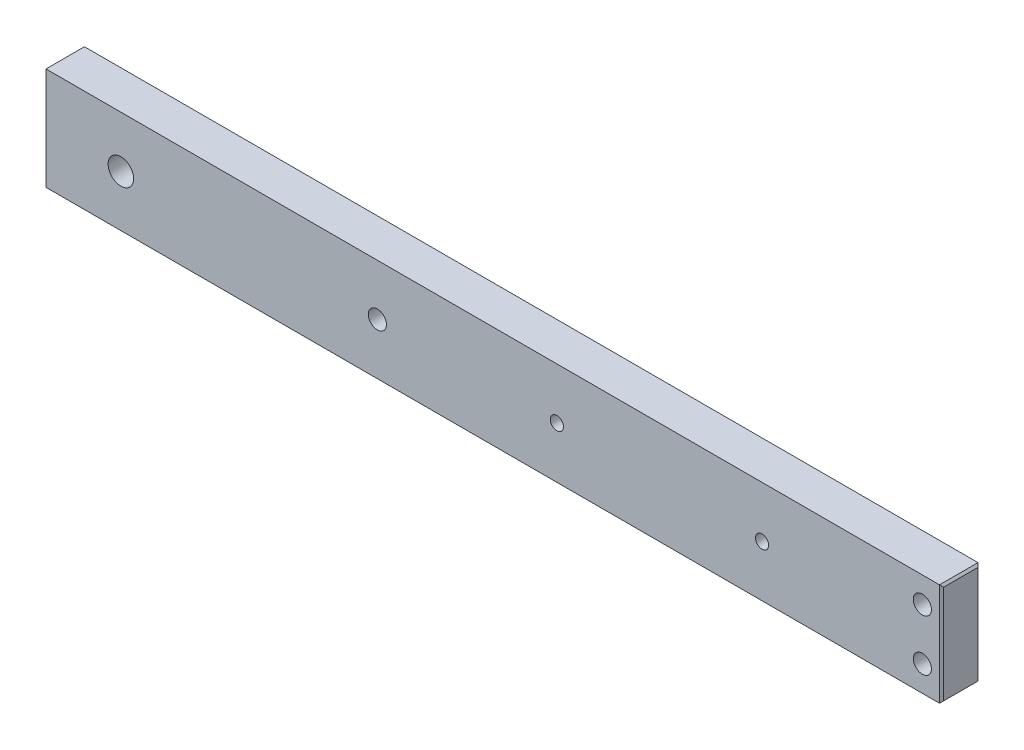
ISO-10303-21;
HEADER;
FILE_DESCRIPTION(('STEP AP214'),'2;1');
FILE_NAME('part.step','',(''),(''),'','','');
FILE_SCHEMA(('AUTOMOTIVE_DESIGN { 1 0 10303 214 1 1 1 1 }'));
ENDSEC;
DATA;
#1=APPLICATION_CONTEXT('core data for automotive mechanical design processes');
#2=APPLICATION_PROTOCOL_DEFINITION('international standard','automotive_design',2000,#1);
#3=PRODUCT_CONTEXT('',#1,'mechanical');
#4=PRODUCT('Part','Part','',(#3));
#5=PRODUCT_RELATED_PRODUCT_CATEGORY('part','',(#4));
#6=PRODUCT_DEFINITION_FORMATION('','',#4);
#7=PRODUCT_DEFINITION_CONTEXT('part definition',#1,'design');
#8=PRODUCT_DEFINITION('design','',#6,#7);
#9=PRODUCT_DEFINITION_SHAPE('','',#8);
#10=(LENGTH_UNIT() NAMED_UNIT(*) SI_UNIT(.MILLI.,.METRE.));
#11=(NAMED_UNIT(*) PLANE_ANGLE_UNIT() SI_UNIT($,.RADIAN.));
#12=(NAMED_UNIT(*) SI_UNIT($,.STERADIAN.) SOLID_ANGLE_UNIT());
#13=UNCERTAINTY_MEASURE_WITH_UNIT(LENGTH_MEASURE(1.E-05),#10,'distance_accuracy_value','');
#14=(GEOMETRIC_REPRESENTATION_CONTEXT(3) GLOBAL_UNCERTAINTY_ASSIGNED_CONTEXT((#13)) GLOBAL_UNIT_ASSIGNED_CONTEXT((#10,
#11,#12)) REPRESENTATION_CONTEXT('',''));
#15=CARTESIAN_POINT('',(0.,0.,0.));
#16=DIRECTION('',(0.,0.,1.));
#17=DIRECTION('',(1.,0.,0.));
#18=AXIS2_PLACEMENT_3D('',#15,#16,#17);
#19=CARTESIAN_POINT('',(0.,0.,9.525));
#20=DIRECTION('',(-1.,0.,0.));
#21=DIRECTION('',(0.,0.,1.));
#22=AXIS2_PLACEMENT_3D('',#19,#20,#21);
#23=PLANE('',#22);
#24=DIRECTION('',(0.,-1.,0.));
#25=VECTOR('',#24,1.);
#26=CARTESIAN_POINT('',(0.,0.,9.01699999999999));
#27=LINE('',#26,#25);
#28=CARTESIAN_POINT('',(0.,24.892,9.01699999999999));
#29=VERTEX_POINT('',#28);
#30=CARTESIAN_POINT('',(0.,0.508000000000008,9.01699999999999));
#31=VERTEX_POINT('',#30);
#32=EDGE_CURVE('E123',#29,#31,#27,.T.);
#33=ORIENTED_EDGE('',*,*,#32,.T.);
#34=DIRECTION('',(0.,0.,-1.));
#35=VECTOR('',#34,1.);
#36=CARTESIAN_POINT('',(0.,0.508000000000008,9.525));
#37=LINE('',#36,#35);
#38=CARTESIAN_POINT('',(0.,0.508000000000008,0.508000000000008));
#39=VERTEX_POINT('',#38);
#40=EDGE_CURVE('E105',#31,#39,#37,.T.);
#41=ORIENTED_EDGE('',*,*,#40,.T.);
#42=DIRECTION('',(0.,1.,0.));
#43=VECTOR('',#42,1.);
#44=CARTESIAN_POINT('',(0.,0.,0.508000000000008));
#45=LINE('',#44,#43);
#46=CARTESIAN_POINT('',(0.,24.892,0.508000000000008));
#47=VERTEX_POINT('',#46);
#48=EDGE_CURVE('E113',#39,#47,#45,.T.);
#49=ORIENTED_EDGE('',*,*,#48,.T.);
#50=DIRECTION('',(0.,0.,1.));
#51=VECTOR('',#50,1.);
#52=CARTESIAN_POINT('',(0.,24.892,9.525));
#53=LINE('',#52,#51);
#54=EDGE_CURVE('E119',#47,#29,#53,.T.);
#55=ORIENTED_EDGE('',*,*,#54,.T.);
#56=EDGE_LOOP('',(#33,#41,#49,#55));
#57=FACE_BOUND('',#56,.T.);
#58=ADVANCED_FACE('F35',(#57),#23,.F.);
#59=CARTESIAN_POINT('',(0.,25.4,9.525));
#60=DIRECTION('',(0.,-1.,0.));
#61=DIRECTION('',(1.,0.,0.));
#62=AXIS2_PLACEMENT_3D('',#59,#60,#61);
#63=PLANE('',#62);
#64=DIRECTION('',(-1.,0.,0.));
#65=VECTOR('',#64,1.);
#66=CARTESIAN_POINT('',(0.,25.4,9.525));
#67=LINE('',#66,#65);
#68=CARTESIAN_POINT('',(-0.508000000000036,25.4,9.525));
#69=VERTEX_POINT('',#68);
#70=CARTESIAN_POINT('',(-221.742,25.4,9.525));
#71=VERTEX_POINT('',#70);
#72=EDGE_CURVE('E182',#69,#71,#67,.T.);
#73=ORIENTED_EDGE('',*,*,#72,.F.);
#74=DIRECTION('',(0.,0.,-1.));
#75=VECTOR('',#74,1.);
#76=CARTESIAN_POINT('',(-0.508000000000036,25.4,9.525));
#77=LINE('',#76,#75);
#78=CARTESIAN_POINT('',(-0.508000000000036,25.4,0.));
#79=VERTEX_POINT('',#78);
#80=EDGE_CURVE('E139',#69,#79,#77,.T.);
#81=ORIENTED_EDGE('',*,*,#80,.T.);
#82=DIRECTION('',(-1.,0.,0.));
#83=VECTOR('',#82,1.);
#84=CARTESIAN_POINT('',(0.,25.4,0.));
#85=LINE('',#84,#83);
#86=CARTESIAN_POINT('',(-221.742,25.4,0.));
#87=VERTEX_POINT('',#86);
#88=EDGE_CURVE('E183',#79,#87,#85,.T.);
#89=ORIENTED_EDGE('',*,*,#88,.T.);
#90=DIRECTION('',(0.,0.,1.));
#91=VECTOR('',#90,1.);
#92=CARTESIAN_POINT('',(-221.742,25.4,9.525));
#93=LINE('',#92,#91);
#94=EDGE_CURVE('E136',#87,#71,#93,.T.);
#95=ORIENTED_EDGE('',*,*,#94,.T.);
#96=EDGE_LOOP('',(#73,#81,#89,#95));
#97=FACE_BOUND('',#96,.T.);
#98=ADVANCED_FACE('F263',(#97),#63,.F.);
#99=CARTESIAN_POINT('',(-222.25,0.,9.525));
#100=DIRECTION('',(1.,0.,0.));
#101=DIRECTION('',(0.,0.,-1.));
#102=AXIS2_PLACEMENT_3D('',#99,#100,#101);
#103=PLANE('',#102);
#104=DIRECTION('',(0.,1.,0.));
#105=VECTOR('',#104,1.);
#106=CARTESIAN_POINT('',(-222.25,25.4,9.01699999999999));
#107=LINE('',#106,#105);
#108=CARTESIAN_POINT('',(-222.25,0.507999999999981,9.01699999999999));
#109=VERTEX_POINT('',#108);
#110=CARTESIAN_POINT('',(-222.25,24.892,9.01699999999999));
#111=VERTEX_POINT('',#110);
#112=EDGE_CURVE('E44',#109,#111,#107,.T.);
#113=ORIENTED_EDGE('',*,*,#112,.T.);
#114=DIRECTION('',(0.,0.,-1.));
#115=VECTOR('',#114,1.);
#116=CARTESIAN_POINT('',(-222.25,24.892,9.525));
#117=LINE('',#116,#115);
#118=CARTESIAN_POINT('',(-222.25,24.892,0.508000000000008));
#119=VERTEX_POINT('',#118);
#120=EDGE_CURVE('E11',#111,#119,#117,.T.);
#121=ORIENTED_EDGE('',*,*,#120,.T.);
#122=DIRECTION('',(0.,-1.,0.));
#123=VECTOR('',#122,1.);
#124=CARTESIAN_POINT('',(-222.25,0.,0.508000000000008));
#125=LINE('',#124,#123);
#126=CARTESIAN_POINT('',(-222.25,0.507999999999981,0.508000000000008));
#127=VERTEX_POINT('',#126);
#128=EDGE_CURVE('E145',#119,#127,#125,.T.);
#129=ORIENTED_EDGE('',*,*,#128,.T.);
#130=DIRECTION('',(0.,0.,1.));
#131=VECTOR('',#130,1.);
#132=CARTESIAN_POINT('',(-222.25,0.507999999999981,9.525));
#133=LINE('',#132,#131);
#134=EDGE_CURVE('E55',#127,#109,#133,.T.);
#135=ORIENTED_EDGE('',*,*,#134,.T.);
#136=EDGE_LOOP('',(#113,#121,#129,#135));
#137=FACE_BOUND('',#136,.T.);
#138=ADVANCED_FACE('F268',(#137),#103,.F.);
#139=CARTESIAN_POINT('',(0.,0.,9.525));
#140=DIRECTION('',(0.,1.,0.));
#141=DIRECTION('',(-1.,0.,0.));
#142=AXIS2_PLACEMENT_3D('',#139,#140,#141);
#143=PLANE('',#142);
#144=DIRECTION('',(1.,0.,0.));
#145=VECTOR('',#144,1.);
#146=CARTESIAN_POINT('',(0.,0.,0.));
#147=LINE('',#146,#145);
#148=CARTESIAN_POINT('',(-221.742,0.,0.));
#149=VERTEX_POINT('',#148);
#150=CARTESIAN_POINT('',(-0.508000000000036,0.,0.));
#151=VERTEX_POINT('',#150);
#152=EDGE_CURVE('E176',#149,#151,#147,.T.);
#153=ORIENTED_EDGE('',*,*,#152,.T.);
#154=DIRECTION('',(0.,0.,1.));
#155=VECTOR('',#154,1.);
#156=CARTESIAN_POINT('',(-0.508000000000036,0.,9.525));
#157=LINE('',#156,#155);
#158=CARTESIAN_POINT('',(-0.508000000000036,0.,9.525));
#159=VERTEX_POINT('',#158);
#160=EDGE_CURVE('E107',#151,#159,#157,.T.);
#161=ORIENTED_EDGE('',*,*,#160,.T.);
#162=DIRECTION('',(1.,0.,0.));
#163=VECTOR('',#162,1.);
#164=CARTESIAN_POINT('',(0.,0.,9.525));
#165=LINE('',#164,#163);
#166=CARTESIAN_POINT('',(-221.742,0.,9.525));
#167=VERTEX_POINT('',#166);
#168=EDGE_CURVE('E120',#167,#159,#165,.T.);
#169=ORIENTED_EDGE('',*,*,#168,.F.);
#170=DIRECTION('',(0.,0.,-1.));
#171=VECTOR('',#170,1.);
#172=CARTESIAN_POINT('',(-221.742,0.,9.525));
#173=LINE('',#172,#171);
#174=EDGE_CURVE('E125',#167,#149,#173,.T.);
#175=ORIENTED_EDGE('',*,*,#174,.T.);
#176=EDGE_LOOP('',(#153,#161,#169,#175));
#177=FACE_BOUND('',#176,.T.);
#178=ADVANCED_FACE('F175',(#177),#143,.F.);
#179=CARTESIAN_POINT('',(0.,0.,9.525));
#180=DIRECTION('',(0.,0.,1.));
#181=DIRECTION('',(1.,0.,0.));
#182=AXIS2_PLACEMENT_3D('',#179,#180,#181);
#183=PLANE('',#182);
#184=CARTESIAN_POINT('',(-95.2500000000001,12.7,9.525));
#185=DIRECTION('',(0.,0.,-1.));
#186=DIRECTION('',(-1.,0.,0.));
#187=AXIS2_PLACEMENT_3D('',#184,#185,#186);
#188=CIRCLE('',#187,1.63194999999999);
#189=CARTESIAN_POINT('',(-96.88195,12.7,9.525));
#190=VERTEX_POINT('',#189);
#191=EDGE_CURVE('E228',#190,#190,#188,.T.);
#192=ORIENTED_EDGE('',*,*,#191,.T.);
#193=EDGE_LOOP('',(#192));
#194=FACE_BOUND('',#193,.T.);
#195=CARTESIAN_POINT('',(-44.4500000000001,12.7,9.525));
#196=DIRECTION('',(0.,0.,-1.));
#197=DIRECTION('',(-1.,0.,0.));
#198=AXIS2_PLACEMENT_3D('',#195,#196,#197);
#199=CIRCLE('',#198,1.63194999999999);
#200=CARTESIAN_POINT('',(-46.08195,12.7,9.525));
#201=VERTEX_POINT('',#200);
#202=EDGE_CURVE('E158',#201,#201,#199,.T.);
#203=ORIENTED_EDGE('',*,*,#202,.T.);
#204=EDGE_LOOP('',(#203));
#205=FACE_BOUND('',#204,.T.);
#206=CARTESIAN_POINT('',(-139.7,12.7,9.525));
#207=DIRECTION('',(0.,0.,1.));
#208=DIRECTION('',(1.,0.,0.));
#209=AXIS2_PLACEMENT_3D('',#206,#207,#208);
#210=CIRCLE('',#209,2.2479);
#211=CARTESIAN_POINT('',(-137.4521,12.7,9.525));
#212=VERTEX_POINT('',#211);
#213=EDGE_CURVE('E154',#212,#212,#210,.T.);
#214=ORIENTED_EDGE('',*,*,#213,.F.);
#215=EDGE_LOOP('',(#214));
#216=FACE_BOUND('',#215,.T.);
#217=CARTESIAN_POINT('',(-203.2,12.7,9.525));
#218=DIRECTION('',(0.,0.,1.));
#219=DIRECTION('',(1.,0.,0.));
#220=AXIS2_PLACEMENT_3D('',#217,#218,#219);
#221=CIRCLE('',#220,3.1623);
#222=CARTESIAN_POINT('',(-200.0377,12.7,9.525));
#223=VERTEX_POINT('',#222);
#224=EDGE_CURVE('E213',#223,#223,#221,.T.);
#225=ORIENTED_EDGE('',*,*,#224,.F.);
#226=EDGE_LOOP('',(#225));
#227=FACE_BOUND('',#226,.T.);
#228=CARTESIAN_POINT('',(-4.7625,6.34999999999999,9.525));
#229=DIRECTION('',(0.,0.,1.));
#230=DIRECTION('',(1.,0.,0.));
#231=AXIS2_PLACEMENT_3D('',#228,#229,#230);
#232=CIRCLE('',#231,2.24789999999999);
#233=CARTESIAN_POINT('',(-2.51460000000001,6.34999999999999,9.525));
#234=VERTEX_POINT('',#233);
#235=EDGE_CURVE('E209',#234,#234,#232,.T.);
#236=ORIENTED_EDGE('',*,*,#235,.F.);
#237=EDGE_LOOP('',(#236));
#238=FACE_BOUND('',#237,.T.);
#239=CARTESIAN_POINT('',(-4.7625,19.05,9.525));
#240=DIRECTION('',(0.,0.,1.));
#241=DIRECTION('',(1.,0.,0.));
#242=AXIS2_PLACEMENT_3D('',#239,#240,#241);
#243=CIRCLE('',#242,2.24789999999999);
#244=CARTESIAN_POINT('',(-2.51460000000001,19.05,9.525));
#245=VERTEX_POINT('',#244);
#246=EDGE_CURVE('E192',#245,#245,#243,.T.);
#247=ORIENTED_EDGE('',*,*,#246,.F.);
#248=EDGE_LOOP('',(#247));
#249=FACE_BOUND('',#248,.T.);
#250=ORIENTED_EDGE('',*,*,#168,.T.);
#251=DIRECTION('',(0.,1.,0.));
#252=VECTOR('',#251,1.);
#253=CARTESIAN_POINT('',(-0.508000000000036,25.4,9.525));
#254=LINE('',#253,#252);
#255=EDGE_CURVE('E134',#159,#69,#254,.T.);
#256=ORIENTED_EDGE('',*,*,#255,.T.);
#257=ORIENTED_EDGE('',*,*,#72,.T.);
#258=DIRECTION('',(0.,-1.,0.));
#259=VECTOR('',#258,1.);
#260=CARTESIAN_POINT('',(-221.742,0.,9.525));
#261=LINE('',#260,#259);
#262=EDGE_CURVE('E132',#71,#167,#261,.T.);
#263=ORIENTED_EDGE('',*,*,#262,.T.);
#264=EDGE_LOOP('',(#250,#256,#257,#263));
#265=FACE_BOUND('',#264,.T.);
#266=ADVANCED_FACE('F202',(#194,#205,#216,#227,#238,#249,#265),#183,.T.);
#267=CARTESIAN_POINT('',(0.,0.,0.));
#268=DIRECTION('',(0.,0.,1.));
#269=DIRECTION('',(1.,0.,0.));
#270=AXIS2_PLACEMENT_3D('',#267,#268,#269);
#271=PLANE('',#270);
#272=CARTESIAN_POINT('',(-95.2500000000001,12.7,0.));
#273=DIRECTION('',(0.,0.,-1.));
#274=DIRECTION('',(-1.,0.,0.));
#275=AXIS2_PLACEMENT_3D('',#272,#273,#274);
#276=CIRCLE('',#275,1.63194999999999);
#277=CARTESIAN_POINT('',(-96.88195,12.7,0.));
#278=VERTEX_POINT('',#277);
#279=EDGE_CURVE('E231',#278,#278,#276,.T.);
#280=ORIENTED_EDGE('',*,*,#279,.F.);
#281=EDGE_LOOP('',(#280));
#282=FACE_BOUND('',#281,.T.);
#283=CARTESIAN_POINT('',(-44.4500000000001,12.7,0.));
#284=DIRECTION('',(0.,0.,-1.));
#285=DIRECTION('',(-1.,0.,0.));
#286=AXIS2_PLACEMENT_3D('',#283,#284,#285);
#287=CIRCLE('',#286,1.63194999999999);
#288=CARTESIAN_POINT('',(-46.08195,12.7,0.));
#289=VERTEX_POINT('',#288);
#290=EDGE_CURVE('E225',#289,#289,#287,.T.);
#291=ORIENTED_EDGE('',*,*,#290,.F.);
#292=EDGE_LOOP('',(#291));
#293=FACE_BOUND('',#292,.T.);
#294=CARTESIAN_POINT('',(-139.7,12.7,0.));
#295=DIRECTION('',(0.,0.,1.));
#296=DIRECTION('',(1.,0.,0.));
#297=AXIS2_PLACEMENT_3D('',#294,#295,#296);
#298=CIRCLE('',#297,2.2479);
#299=CARTESIAN_POINT('',(-137.4521,12.7,0.));
#300=VERTEX_POINT('',#299);
#301=EDGE_CURVE('E216',#300,#300,#298,.T.);
#302=ORIENTED_EDGE('',*,*,#301,.T.);
#303=EDGE_LOOP('',(#302));
#304=FACE_BOUND('',#303,.T.);
#305=CARTESIAN_POINT('',(-203.2,12.7,0.));
#306=DIRECTION('',(0.,0.,1.));
#307=DIRECTION('',(1.,0.,0.));
#308=AXIS2_PLACEMENT_3D('',#305,#306,#307);
#309=CIRCLE('',#308,3.1623);
#310=CARTESIAN_POINT('',(-200.0377,12.7,0.));
#311=VERTEX_POINT('',#310);
#312=EDGE_CURVE('E212',#311,#311,#309,.T.);
#313=ORIENTED_EDGE('',*,*,#312,.T.);
#314=EDGE_LOOP('',(#313));
#315=FACE_BOUND('',#314,.T.);
#316=CARTESIAN_POINT('',(-4.7625,6.34999999999999,0.));
#317=DIRECTION('',(0.,0.,1.));
#318=DIRECTION('',(1.,0.,0.));
#319=AXIS2_PLACEMENT_3D('',#316,#317,#318);
#320=CIRCLE('',#319,2.24789999999999);
#321=CARTESIAN_POINT('',(-2.51460000000001,6.34999999999999,0.));
#322=VERTEX_POINT('',#321);
#323=EDGE_CURVE('E206',#322,#322,#320,.T.);
#324=ORIENTED_EDGE('',*,*,#323,.T.);
#325=EDGE_LOOP('',(#324));
#326=FACE_BOUND('',#325,.T.);
#327=CARTESIAN_POINT('',(-4.7625,19.05,0.));
#328=DIRECTION('',(0.,0.,1.));
#329=DIRECTION('',(1.,0.,0.));
#330=AXIS2_PLACEMENT_3D('',#327,#328,#329);
#331=CIRCLE('',#330,2.24789999999999);
#332=CARTESIAN_POINT('',(-2.51460000000001,19.05,0.));
#333=VERTEX_POINT('',#332);
#334=EDGE_CURVE('E187',#333,#333,#331,.T.);
#335=ORIENTED_EDGE('',*,*,#334,.T.);
#336=EDGE_LOOP('',(#335));
#337=FACE_BOUND('',#336,.T.);
#338=ORIENTED_EDGE('',*,*,#88,.F.);
#339=DIRECTION('',(0.,-1.,0.));
#340=VECTOR('',#339,1.);
#341=CARTESIAN_POINT('',(-0.508000000000036,0.,0.));
#342=LINE('',#341,#340);
#343=EDGE_CURVE('E143',#79,#151,#342,.T.);
#344=ORIENTED_EDGE('',*,*,#343,.T.);
#345=ORIENTED_EDGE('',*,*,#152,.F.);
#346=DIRECTION('',(0.,1.,0.));
#347=VECTOR('',#346,1.);
#348=CARTESIAN_POINT('',(-221.742,0.,0.));
#349=LINE('',#348,#347);
#350=EDGE_CURVE('E141',#149,#87,#349,.T.);
#351=ORIENTED_EDGE('',*,*,#350,.T.);
#352=EDGE_LOOP('',(#338,#344,#345,#351));
#353=FACE_BOUND('',#352,.T.);
#354=ADVANCED_FACE('F180',(#282,#293,#304,#315,#326,#337,#353),#271,.F.);
#355=CARTESIAN_POINT('',(-4.7625,19.05,9.525));
#356=DIRECTION('',(0.,0.,1.));
#357=DIRECTION('',(1.,0.,0.));
#358=AXIS2_PLACEMENT_3D('',#355,#356,#357);
#359=CYLINDRICAL_SURFACE('',#358,2.24789999999999);
#360=ORIENTED_EDGE('',*,*,#246,.T.);
#361=EDGE_LOOP('',(#360));
#362=FACE_BOUND('',#361,.T.);
#363=ORIENTED_EDGE('',*,*,#334,.F.);
#364=EDGE_LOOP('',(#363));
#365=FACE_BOUND('',#364,.T.);
#366=ADVANCED_FACE('F239',(#362,#365),#359,.F.);
#367=CARTESIAN_POINT('',(-4.7625,6.34999999999999,9.525));
#368=DIRECTION('',(0.,0.,1.));
#369=DIRECTION('',(1.,0.,0.));
#370=AXIS2_PLACEMENT_3D('',#367,#368,#369);
#371=CYLINDRICAL_SURFACE('',#370,2.24789999999999);
#372=ORIENTED_EDGE('',*,*,#235,.T.);
#373=EDGE_LOOP('',(#372));
#374=FACE_BOUND('',#373,.T.);
#375=ORIENTED_EDGE('',*,*,#323,.F.);
#376=EDGE_LOOP('',(#375));
#377=FACE_BOUND('',#376,.T.);
#378=ADVANCED_FACE('F252',(#374,#377),#371,.F.);
#379=CARTESIAN_POINT('',(-203.2,12.7,0.));
#380=DIRECTION('',(0.,0.,1.));
#381=DIRECTION('',(1.,0.,0.));
#382=AXIS2_PLACEMENT_3D('',#379,#380,#381);
#383=CYLINDRICAL_SURFACE('',#382,3.1623);
#384=ORIENTED_EDGE('',*,*,#312,.F.);
#385=EDGE_LOOP('',(#384));
#386=FACE_BOUND('',#385,.T.);
#387=ORIENTED_EDGE('',*,*,#224,.T.);
#388=EDGE_LOOP('',(#387));
#389=FACE_BOUND('',#388,.T.);
#390=ADVANCED_FACE('F258',(#386,#389),#383,.F.);
#391=CARTESIAN_POINT('',(-139.7,12.7,9.525));
#392=DIRECTION('',(0.,0.,1.));
#393=DIRECTION('',(1.,0.,0.));
#394=AXIS2_PLACEMENT_3D('',#391,#392,#393);
#395=CYLINDRICAL_SURFACE('',#394,2.2479);
#396=ORIENTED_EDGE('',*,*,#213,.T.);
#397=EDGE_LOOP('',(#396));
#398=FACE_BOUND('',#397,.T.);
#399=ORIENTED_EDGE('',*,*,#301,.F.);
#400=EDGE_LOOP('',(#399));
#401=FACE_BOUND('',#400,.T.);
#402=ADVANCED_FACE('F281',(#398,#401),#395,.F.);
#403=CARTESIAN_POINT('',(-0.508000000000036,25.4,9.525));
#404=DIRECTION('',(-0.707106781186528,-0.707106781186567,0.));
#405=DIRECTION('',(0.,0.,-1.));
#406=AXIS2_PLACEMENT_3D('',#403,#404,#405);
#407=PLANE('',#406);
#408=DIRECTION('',(0.577350269189647,-0.577350269189615,0.577350269189615));
#409=VECTOR('',#408,1.);
#410=CARTESIAN_POINT('',(8.29733333333348,16.594666666667,8.80533333333304));
#411=LINE('',#410,#409);
#412=EDGE_CURVE('E116',#79,#47,#411,.T.);
#413=ORIENTED_EDGE('',*,*,#412,.F.);
#414=ORIENTED_EDGE('',*,*,#80,.F.);
#415=DIRECTION('',(-0.577350269189647,0.577350269189615,0.577350269189615));
#416=VECTOR('',#415,1.);
#417=CARTESIAN_POINT('',(-0.508000000000036,25.4,9.525));
#418=LINE('',#417,#416);
#419=EDGE_CURVE('E151',#29,#69,#418,.T.);
#420=ORIENTED_EDGE('',*,*,#419,.F.);
#421=ORIENTED_EDGE('',*,*,#54,.F.);
#422=EDGE_LOOP('',(#413,#414,#420,#421));
#423=FACE_BOUND('',#422,.T.);
#424=ADVANCED_FACE('F196',(#423),#407,.F.);
#425=CARTESIAN_POINT('',(-0.508000000000036,0.,9.525));
#426=DIRECTION('',(0.707106781186528,0.,0.707106781186567));
#427=DIRECTION('',(0.,-1.,0.));
#428=AXIS2_PLACEMENT_3D('',#425,#426,#427);
#429=PLANE('',#428);
#430=ORIENTED_EDGE('',*,*,#419,.T.);
#431=ORIENTED_EDGE('',*,*,#255,.F.);
#432=DIRECTION('',(-0.577350269189647,-0.577350269189615,0.577350269189616));
#433=VECTOR('',#432,1.);
#434=CARTESIAN_POINT('',(-0.508000000000036,0.,9.525));
#435=LINE('',#434,#433);
#436=EDGE_CURVE('E110',#31,#159,#435,.T.);
#437=ORIENTED_EDGE('',*,*,#436,.F.);
#438=ORIENTED_EDGE('',*,*,#32,.F.);
#439=EDGE_LOOP('',(#430,#431,#437,#438));
#440=FACE_BOUND('',#439,.T.);
#441=ADVANCED_FACE('F199',(#440),#429,.T.);
#442=CARTESIAN_POINT('',(0.,0.,0.508000000000008));
#443=DIRECTION('',(-0.707106781186528,0.,0.707106781186567));
#444=DIRECTION('',(0.,1.,0.));
#445=AXIS2_PLACEMENT_3D('',#442,#443,#444);
#446=PLANE('',#445);
#447=ORIENTED_EDGE('',*,*,#412,.T.);
#448=ORIENTED_EDGE('',*,*,#48,.F.);
#449=DIRECTION('',(-0.577350269189647,-0.577350269189615,-0.577350269189616));
#450=VECTOR('',#449,1.);
#451=CARTESIAN_POINT('',(-0.169333333333339,0.338666666666678,0.338666666666679));
#452=LINE('',#451,#450);
#453=EDGE_CURVE('E101',#151,#39,#452,.F.);
#454=ORIENTED_EDGE('',*,*,#453,.F.);
#455=ORIENTED_EDGE('',*,*,#343,.F.);
#456=EDGE_LOOP('',(#447,#448,#454,#455));
#457=FACE_BOUND('',#456,.T.);
#458=ADVANCED_FACE('F114',(#457),#446,.F.);
#459=CARTESIAN_POINT('',(0.,0.508000000000008,9.525));
#460=DIRECTION('',(-0.707106781186528,0.707106781186567,0.));
#461=DIRECTION('',(0.,0.,-1.));
#462=AXIS2_PLACEMENT_3D('',#459,#460,#461);
#463=PLANE('',#462);
#464=ORIENTED_EDGE('',*,*,#436,.T.);
#465=ORIENTED_EDGE('',*,*,#160,.F.);
#466=ORIENTED_EDGE('',*,*,#453,.T.);
#467=ORIENTED_EDGE('',*,*,#40,.F.);
#468=EDGE_LOOP('',(#464,#465,#466,#467));
#469=FACE_BOUND('',#468,.T.);
#470=ADVANCED_FACE('F103',(#469),#463,.F.);
#471=CARTESIAN_POINT('',(-221.742,0.,9.525));
#472=DIRECTION('',(0.707106781186528,0.707106781186567,0.));
#473=DIRECTION('',(0.,0.,-1.));
#474=AXIS2_PLACEMENT_3D('',#471,#472,#473);
#475=PLANE('',#474);
#476=DIRECTION('',(-0.577350269189647,0.577350269189615,0.577350269189615));
#477=VECTOR('',#476,1.);
#478=CARTESIAN_POINT('',(-222.080666666667,0.338666666666651,0.338666666666679));
#479=LINE('',#478,#477);
#480=EDGE_CURVE('E159',#149,#127,#479,.T.);
#481=ORIENTED_EDGE('',*,*,#480,.F.);
#482=ORIENTED_EDGE('',*,*,#174,.F.);
#483=DIRECTION('',(0.577350269189647,-0.577350269189615,0.577350269189615));
#484=VECTOR('',#483,1.);
#485=CARTESIAN_POINT('',(-221.742,0.,9.525));
#486=LINE('',#485,#484);
#487=EDGE_CURVE('E39',#109,#167,#486,.T.);
#488=ORIENTED_EDGE('',*,*,#487,.F.);
#489=ORIENTED_EDGE('',*,*,#134,.F.);
#490=EDGE_LOOP('',(#481,#482,#488,#489));
#491=FACE_BOUND('',#490,.T.);
#492=ADVANCED_FACE('F37',(#491),#475,.F.);
#493=CARTESIAN_POINT('',(-221.742,0.,9.525));
#494=DIRECTION('',(-0.707106781186528,0.,0.707106781186567));
#495=DIRECTION('',(0.,1.,0.));
#496=AXIS2_PLACEMENT_3D('',#493,#494,#495);
#497=PLANE('',#496);
#498=ORIENTED_EDGE('',*,*,#487,.T.);
#499=ORIENTED_EDGE('',*,*,#262,.F.);
#500=DIRECTION('',(0.577350269189647,0.577350269189615,0.577350269189615));
#501=VECTOR('',#500,1.);
#502=CARTESIAN_POINT('',(-230.208666666667,16.9333333333336,1.05833333333365));
#503=LINE('',#502,#501);
#504=EDGE_CURVE('E157',#111,#71,#503,.T.);
#505=ORIENTED_EDGE('',*,*,#504,.F.);
#506=ORIENTED_EDGE('',*,*,#112,.F.);
#507=EDGE_LOOP('',(#498,#499,#505,#506));
#508=FACE_BOUND('',#507,.T.);
#509=ADVANCED_FACE('F168',(#508),#497,.T.);
#510=CARTESIAN_POINT('',(-222.25,0.,0.508000000000008));
#511=DIRECTION('',(0.707106781186528,0.,0.707106781186567));
#512=DIRECTION('',(0.,-1.,0.));
#513=AXIS2_PLACEMENT_3D('',#510,#511,#512);
#514=PLANE('',#513);
#515=ORIENTED_EDGE('',*,*,#480,.T.);
#516=ORIENTED_EDGE('',*,*,#128,.F.);
#517=DIRECTION('',(0.577350269189647,0.577350269189615,-0.577350269189615));
#518=VECTOR('',#517,1.);
#519=CARTESIAN_POINT('',(-230.547333333333,16.5946666666669,8.80533333333304));
#520=LINE('',#519,#518);
#521=EDGE_CURVE('E155',#87,#119,#520,.F.);
#522=ORIENTED_EDGE('',*,*,#521,.F.);
#523=ORIENTED_EDGE('',*,*,#350,.F.);
#524=EDGE_LOOP('',(#515,#516,#522,#523));
#525=FACE_BOUND('',#524,.T.);
#526=ADVANCED_FACE('F286',(#525),#514,.F.);
#527=CARTESIAN_POINT('',(-222.25,24.892,9.525));
#528=DIRECTION('',(0.707106781186528,-0.707106781186567,0.));
#529=DIRECTION('',(0.,0.,-1.));
#530=AXIS2_PLACEMENT_3D('',#527,#528,#529);
#531=PLANE('',#530);
#532=ORIENTED_EDGE('',*,*,#504,.T.);
#533=ORIENTED_EDGE('',*,*,#94,.F.);
#534=ORIENTED_EDGE('',*,*,#521,.T.);
#535=ORIENTED_EDGE('',*,*,#120,.F.);
#536=EDGE_LOOP('',(#532,#533,#534,#535));
#537=FACE_BOUND('',#536,.T.);
#538=ADVANCED_FACE('F282',(#537),#531,.F.);
#539=CARTESIAN_POINT('',(-44.4500000000001,12.7,0.));
#540=DIRECTION('',(0.,0.,-1.));
#541=DIRECTION('',(-1.,0.,0.));
#542=AXIS2_PLACEMENT_3D('',#539,#540,#541);
#543=CYLINDRICAL_SURFACE('',#542,1.63194999999999);
#544=ORIENTED_EDGE('',*,*,#202,.F.);
#545=EDGE_LOOP('',(#544));
#546=FACE_BOUND('',#545,.T.);
#547=ORIENTED_EDGE('',*,*,#290,.T.);
#548=EDGE_LOOP('',(#547));
#549=FACE_BOUND('',#548,.T.);
#550=ADVANCED_FACE('F285',(#546,#549),#543,.F.);
#551=CARTESIAN_POINT('',(-95.2500000000001,12.7,0.));
#552=DIRECTION('',(0.,0.,-1.));
#553=DIRECTION('',(-1.,0.,0.));
#554=AXIS2_PLACEMENT_3D('',#551,#552,#553);
#555=CYLINDRICAL_SURFACE('',#554,1.63194999999999);
#556=ORIENTED_EDGE('',*,*,#191,.F.);
#557=EDGE_LOOP('',(#556));
#558=FACE_BOUND('',#557,.T.);
#559=ORIENTED_EDGE('',*,*,#279,.T.);
#560=EDGE_LOOP('',(#559));
#561=FACE_BOUND('',#560,.T.);
#562=ADVANCED_FACE('F235',(#558,#561),#555,.F.);
#563=CLOSED_SHELL('',(#58,#98,#138,#178,#266,#354,#366,#378,#390,#402,#424,#441,#458,#470,#492,
#509,#526,#538,#550,#562));
#564=MANIFOLD_SOLID_BREP('B2',#563);
#565=ADVANCED_BREP_SHAPE_REPRESENTATION('',(#18,#564),#14);
#566=SHAPE_DEFINITION_REPRESENTATION(#9,#565);
ENDSEC;
END-ISO-10303-21;
